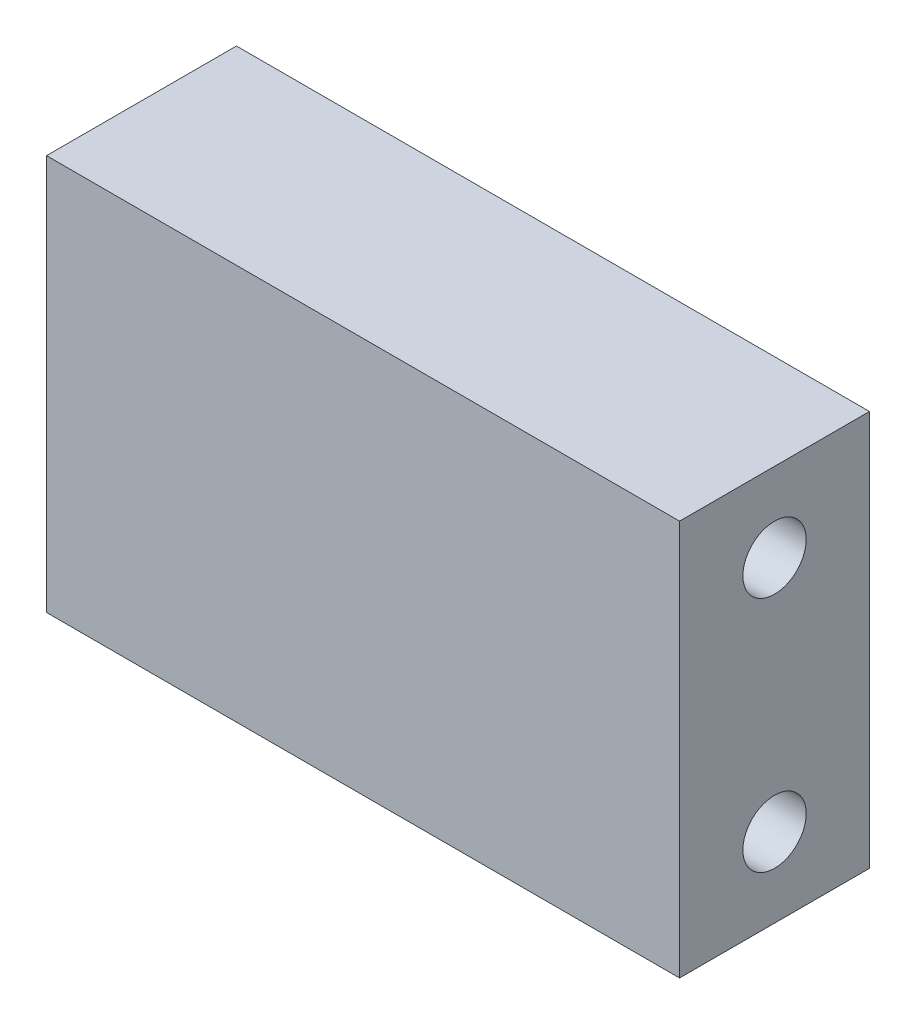
ISO-10303-21;
HEADER;
FILE_DESCRIPTION(('STEP AP214'),'2;1');
FILE_NAME('part.step','',(''),(''),'','','');
FILE_SCHEMA(('AUTOMOTIVE_DESIGN { 1 0 10303 214 1 1 1 1 }'));
ENDSEC;
DATA;
#1=APPLICATION_CONTEXT('core data for automotive mechanical design processes');
#2=APPLICATION_PROTOCOL_DEFINITION('international standard','automotive_design',2000,#1);
#3=PRODUCT_CONTEXT('',#1,'mechanical');
#4=PRODUCT('Part','Part','',(#3));
#5=PRODUCT_RELATED_PRODUCT_CATEGORY('part','',(#4));
#6=PRODUCT_DEFINITION_FORMATION('','',#4);
#7=PRODUCT_DEFINITION_CONTEXT('part definition',#1,'design');
#8=PRODUCT_DEFINITION('design','',#6,#7);
#9=PRODUCT_DEFINITION_SHAPE('','',#8);
#10=(LENGTH_UNIT() NAMED_UNIT(*) SI_UNIT(.MILLI.,.METRE.));
#11=(NAMED_UNIT(*) PLANE_ANGLE_UNIT() SI_UNIT($,.RADIAN.));
#12=(NAMED_UNIT(*) SI_UNIT($,.STERADIAN.) SOLID_ANGLE_UNIT());
#13=UNCERTAINTY_MEASURE_WITH_UNIT(LENGTH_MEASURE(1.E-05),#10,'distance_accuracy_value','');
#14=(GEOMETRIC_REPRESENTATION_CONTEXT(3) GLOBAL_UNCERTAINTY_ASSIGNED_CONTEXT((#13)) GLOBAL_UNIT_ASSIGNED_CONTEXT((#10,
#11,#12)) REPRESENTATION_CONTEXT('',''));
#15=CARTESIAN_POINT('',(0.,0.,0.));
#16=DIRECTION('',(0.,0.,1.));
#17=DIRECTION('',(1.,0.,0.));
#18=AXIS2_PLACEMENT_3D('',#15,#16,#17);
#19=CARTESIAN_POINT('',(40.,0.,12.));
#20=DIRECTION('',(-1.,0.,0.));
#21=DIRECTION('',(0.,0.,1.));
#22=AXIS2_PLACEMENT_3D('',#19,#20,#21);
#23=PLANE('',#22);
#24=CARTESIAN_POINT('',(40.,20.,6.));
#25=DIRECTION('',(1.,0.,0.));
#26=DIRECTION('',(0.,0.,-1.));
#27=AXIS2_PLACEMENT_3D('',#24,#25,#26);
#28=CIRCLE('',#27,2.);
#29=CARTESIAN_POINT('',(40.,20.,4.));
#30=VERTEX_POINT('',#29);
#31=EDGE_CURVE('E119',#30,#30,#28,.T.);
#32=ORIENTED_EDGE('',*,*,#31,.F.);
#33=EDGE_LOOP('',(#32));
#34=FACE_BOUND('',#33,.T.);
#35=DIRECTION('',(0.,1.,0.));
#36=VECTOR('',#35,1.);
#37=CARTESIAN_POINT('',(40.,0.,0.));
#38=LINE('',#37,#36);
#39=CARTESIAN_POINT('',(40.,0.,0.));
#40=VERTEX_POINT('',#39);
#41=CARTESIAN_POINT('',(40.,25.,0.));
#42=VERTEX_POINT('',#41);
#43=EDGE_CURVE('E67',#40,#42,#38,.T.);
#44=ORIENTED_EDGE('',*,*,#43,.T.);
#45=DIRECTION('',(0.,0.,-1.));
#46=VECTOR('',#45,1.);
#47=CARTESIAN_POINT('',(40.,25.,12.));
#48=LINE('',#47,#46);
#49=CARTESIAN_POINT('',(40.,25.,12.));
#50=VERTEX_POINT('',#49);
#51=EDGE_CURVE('E90',#50,#42,#48,.T.);
#52=ORIENTED_EDGE('',*,*,#51,.F.);
#53=DIRECTION('',(0.,1.,0.));
#54=VECTOR('',#53,1.);
#55=CARTESIAN_POINT('',(40.,0.,12.));
#56=LINE('',#55,#54);
#57=CARTESIAN_POINT('',(40.,0.,12.));
#58=VERTEX_POINT('',#57);
#59=EDGE_CURVE('E83',#58,#50,#56,.T.);
#60=ORIENTED_EDGE('',*,*,#59,.F.);
#61=DIRECTION('',(0.,0.,-1.));
#62=VECTOR('',#61,1.);
#63=CARTESIAN_POINT('',(40.,0.,12.));
#64=LINE('',#63,#62);
#65=EDGE_CURVE('E42',#58,#40,#64,.T.);
#66=ORIENTED_EDGE('',*,*,#65,.T.);
#67=EDGE_LOOP('',(#44,#52,#60,#66));
#68=FACE_BOUND('',#67,.T.);
#69=CARTESIAN_POINT('',(40.,5.,6.));
#70=DIRECTION('',(1.,0.,0.));
#71=DIRECTION('',(0.,0.,-1.));
#72=AXIS2_PLACEMENT_3D('',#69,#70,#71);
#73=CIRCLE('',#72,2.);
#74=CARTESIAN_POINT('',(40.,5.,4.));
#75=VERTEX_POINT('',#74);
#76=EDGE_CURVE('E113',#75,#75,#73,.T.);
#77=ORIENTED_EDGE('',*,*,#76,.F.);
#78=EDGE_LOOP('',(#77));
#79=FACE_BOUND('',#78,.T.);
#80=ADVANCED_FACE('F33',(#34,#68,#79),#23,.F.);
#81=CARTESIAN_POINT('',(0.,0.,12.));
#82=DIRECTION('',(1.,0.,0.));
#83=DIRECTION('',(0.,0.,-1.));
#84=AXIS2_PLACEMENT_3D('',#81,#82,#83);
#85=PLANE('',#84);
#86=CARTESIAN_POINT('',(0.,20.,6.));
#87=DIRECTION('',(1.,0.,0.));
#88=DIRECTION('',(0.,0.,-1.));
#89=AXIS2_PLACEMENT_3D('',#86,#87,#88);
#90=CIRCLE('',#89,1.99999999999999);
#91=CARTESIAN_POINT('',(0.,20.,4.00000000000001));
#92=VERTEX_POINT('',#91);
#93=EDGE_CURVE('E116',#92,#92,#90,.T.);
#94=ORIENTED_EDGE('',*,*,#93,.T.);
#95=EDGE_LOOP('',(#94));
#96=FACE_BOUND('',#95,.T.);
#97=CARTESIAN_POINT('',(0.,5.,6.));
#98=DIRECTION('',(1.,0.,0.));
#99=DIRECTION('',(0.,0.,-1.));
#100=AXIS2_PLACEMENT_3D('',#97,#98,#99);
#101=CIRCLE('',#100,1.99999999999999);
#102=CARTESIAN_POINT('',(0.,5.,4.));
#103=VERTEX_POINT('',#102);
#104=EDGE_CURVE('E100',#103,#103,#101,.T.);
#105=ORIENTED_EDGE('',*,*,#104,.T.);
#106=EDGE_LOOP('',(#105));
#107=FACE_BOUND('',#106,.T.);
#108=DIRECTION('',(0.,-1.,0.));
#109=VECTOR('',#108,1.);
#110=CARTESIAN_POINT('',(0.,0.,0.));
#111=LINE('',#110,#109);
#112=CARTESIAN_POINT('',(0.,25.,0.));
#113=VERTEX_POINT('',#112);
#114=CARTESIAN_POINT('',(0.,0.,0.));
#115=VERTEX_POINT('',#114);
#116=EDGE_CURVE('E97',#113,#115,#111,.T.);
#117=ORIENTED_EDGE('',*,*,#116,.T.);
#118=DIRECTION('',(0.,0.,-1.));
#119=VECTOR('',#118,1.);
#120=CARTESIAN_POINT('',(0.,0.,12.));
#121=LINE('',#120,#119);
#122=CARTESIAN_POINT('',(0.,0.,12.));
#123=VERTEX_POINT('',#122);
#124=EDGE_CURVE('E11',#123,#115,#121,.T.);
#125=ORIENTED_EDGE('',*,*,#124,.F.);
#126=DIRECTION('',(0.,-1.,0.));
#127=VECTOR('',#126,1.);
#128=CARTESIAN_POINT('',(0.,0.,12.));
#129=LINE('',#128,#127);
#130=CARTESIAN_POINT('',(0.,25.,12.));
#131=VERTEX_POINT('',#130);
#132=EDGE_CURVE('E85',#131,#123,#129,.T.);
#133=ORIENTED_EDGE('',*,*,#132,.F.);
#134=DIRECTION('',(0.,0.,-1.));
#135=VECTOR('',#134,1.);
#136=CARTESIAN_POINT('',(0.,25.,12.));
#137=LINE('',#136,#135);
#138=EDGE_CURVE('E93',#131,#113,#137,.T.);
#139=ORIENTED_EDGE('',*,*,#138,.T.);
#140=EDGE_LOOP('',(#117,#125,#133,#139));
#141=FACE_BOUND('',#140,.T.);
#142=ADVANCED_FACE('F35',(#96,#107,#141),#85,.F.);
#143=CARTESIAN_POINT('',(0.,0.,12.));
#144=DIRECTION('',(0.,1.,0.));
#145=DIRECTION('',(0.,0.,1.));
#146=AXIS2_PLACEMENT_3D('',#143,#144,#145);
#147=PLANE('',#146);
#148=DIRECTION('',(1.,0.,0.));
#149=VECTOR('',#148,1.);
#150=CARTESIAN_POINT('',(0.,0.,0.));
#151=LINE('',#150,#149);
#152=EDGE_CURVE('E89',#115,#40,#151,.T.);
#153=ORIENTED_EDGE('',*,*,#152,.T.);
#154=ORIENTED_EDGE('',*,*,#65,.F.);
#155=DIRECTION('',(1.,0.,0.));
#156=VECTOR('',#155,1.);
#157=CARTESIAN_POINT('',(0.,0.,12.));
#158=LINE('',#157,#156);
#159=EDGE_CURVE('E80',#123,#58,#158,.T.);
#160=ORIENTED_EDGE('',*,*,#159,.F.);
#161=ORIENTED_EDGE('',*,*,#124,.T.);
#162=EDGE_LOOP('',(#153,#154,#160,#161));
#163=FACE_BOUND('',#162,.T.);
#164=ADVANCED_FACE('F88',(#163),#147,.F.);
#165=CARTESIAN_POINT('',(0.,25.,12.));
#166=DIRECTION('',(0.,-1.,0.));
#167=DIRECTION('',(0.,0.,-1.));
#168=AXIS2_PLACEMENT_3D('',#165,#166,#167);
#169=PLANE('',#168);
#170=DIRECTION('',(-1.,0.,0.));
#171=VECTOR('',#170,1.);
#172=CARTESIAN_POINT('',(0.,25.,0.));
#173=LINE('',#172,#171);
#174=EDGE_CURVE('E73',#42,#113,#173,.T.);
#175=ORIENTED_EDGE('',*,*,#174,.T.);
#176=ORIENTED_EDGE('',*,*,#138,.F.);
#177=DIRECTION('',(-1.,0.,0.));
#178=VECTOR('',#177,1.);
#179=CARTESIAN_POINT('',(0.,25.,12.));
#180=LINE('',#179,#178);
#181=EDGE_CURVE('E50',#50,#131,#180,.T.);
#182=ORIENTED_EDGE('',*,*,#181,.F.);
#183=ORIENTED_EDGE('',*,*,#51,.T.);
#184=EDGE_LOOP('',(#175,#176,#182,#183));
#185=FACE_BOUND('',#184,.T.);
#186=ADVANCED_FACE('F105',(#185),#169,.F.);
#187=CARTESIAN_POINT('',(0.,0.,12.));
#188=DIRECTION('',(0.,0.,-1.));
#189=DIRECTION('',(-1.,0.,0.));
#190=AXIS2_PLACEMENT_3D('',#187,#188,#189);
#191=PLANE('',#190);
#192=ORIENTED_EDGE('',*,*,#132,.T.);
#193=ORIENTED_EDGE('',*,*,#159,.T.);
#194=ORIENTED_EDGE('',*,*,#59,.T.);
#195=ORIENTED_EDGE('',*,*,#181,.T.);
#196=EDGE_LOOP('',(#192,#193,#194,#195));
#197=FACE_BOUND('',#196,.T.);
#198=ADVANCED_FACE('F81',(#197),#191,.F.);
#199=CARTESIAN_POINT('',(0.,0.,0.));
#200=DIRECTION('',(0.,0.,-1.));
#201=DIRECTION('',(-1.,0.,0.));
#202=AXIS2_PLACEMENT_3D('',#199,#200,#201);
#203=PLANE('',#202);
#204=ORIENTED_EDGE('',*,*,#116,.F.);
#205=ORIENTED_EDGE('',*,*,#174,.F.);
#206=ORIENTED_EDGE('',*,*,#43,.F.);
#207=ORIENTED_EDGE('',*,*,#152,.F.);
#208=EDGE_LOOP('',(#204,#205,#206,#207));
#209=FACE_BOUND('',#208,.T.);
#210=ADVANCED_FACE('F108',(#209),#203,.T.);
#211=CARTESIAN_POINT('',(40.,5.,6.));
#212=DIRECTION('',(1.,0.,0.));
#213=DIRECTION('',(0.,0.,-1.));
#214=AXIS2_PLACEMENT_3D('',#211,#212,#213);
#215=CYLINDRICAL_SURFACE('',#214,1.99999999999999);
#216=ORIENTED_EDGE('',*,*,#104,.F.);
#217=EDGE_LOOP('',(#216));
#218=FACE_BOUND('',#217,.T.);
#219=ORIENTED_EDGE('',*,*,#76,.T.);
#220=EDGE_LOOP('',(#219));
#221=FACE_BOUND('',#220,.T.);
#222=ADVANCED_FACE('F144',(#218,#221),#215,.F.);
#223=CARTESIAN_POINT('',(40.,20.,6.));
#224=DIRECTION('',(1.,0.,0.));
#225=DIRECTION('',(0.,0.,-1.));
#226=AXIS2_PLACEMENT_3D('',#223,#224,#225);
#227=CYLINDRICAL_SURFACE('',#226,1.99999999999999);
#228=ORIENTED_EDGE('',*,*,#93,.F.);
#229=EDGE_LOOP('',(#228));
#230=FACE_BOUND('',#229,.T.);
#231=ORIENTED_EDGE('',*,*,#31,.T.);
#232=EDGE_LOOP('',(#231));
#233=FACE_BOUND('',#232,.T.);
#234=ADVANCED_FACE('F123',(#230,#233),#227,.F.);
#235=CLOSED_SHELL('',(#80,#142,#164,#186,#198,#210,#222,#234));
#236=MANIFOLD_SOLID_BREP('B2',#235);
#237=ADVANCED_BREP_SHAPE_REPRESENTATION('',(#18,#236),#14);
#238=SHAPE_DEFINITION_REPRESENTATION(#9,#237);
ENDSEC;
END-ISO-10303-21;
